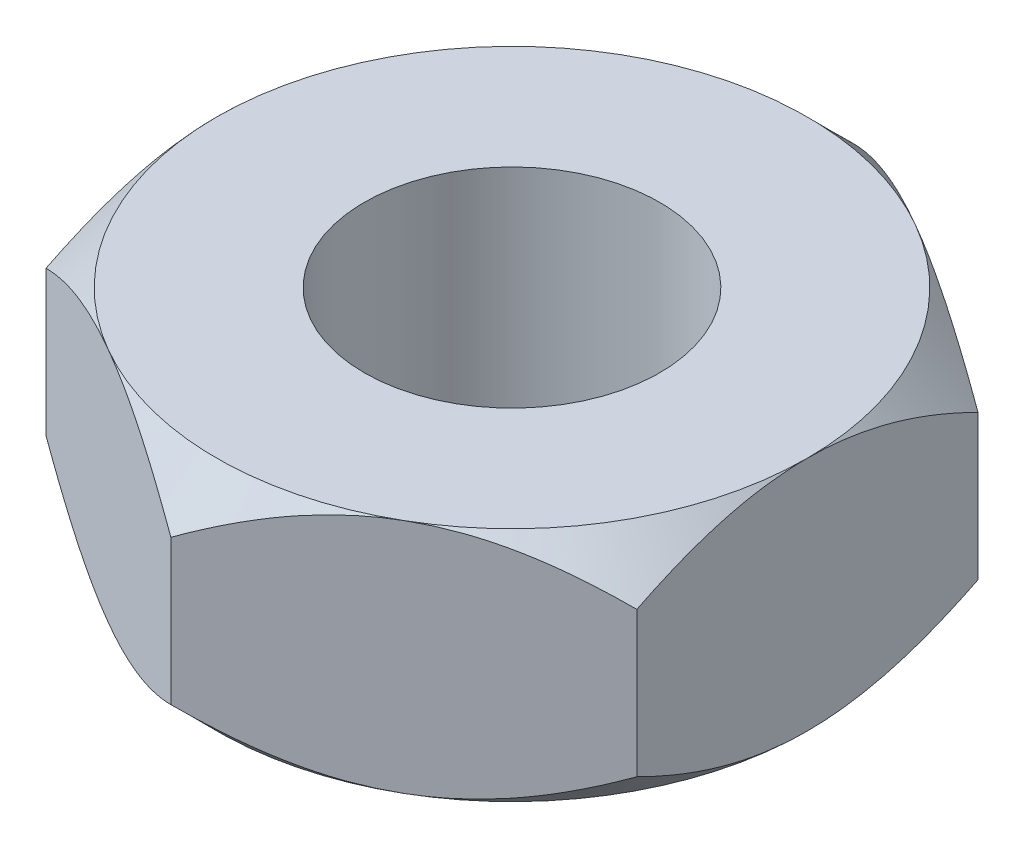
ISO-10303-21;
HEADER;
FILE_DESCRIPTION(('STEP AP214'),'2;1');
FILE_NAME('part.step','',(''),(''),'','','');
FILE_SCHEMA(('AUTOMOTIVE_DESIGN { 1 0 10303 214 1 1 1 1 }'));
ENDSEC;
DATA;
#1=APPLICATION_CONTEXT('core data for automotive mechanical design processes');
#2=APPLICATION_PROTOCOL_DEFINITION('international standard','automotive_design',2000,#1);
#3=PRODUCT_CONTEXT('',#1,'mechanical');
#4=PRODUCT('Part','Part','',(#3));
#5=PRODUCT_RELATED_PRODUCT_CATEGORY('part','',(#4));
#6=PRODUCT_DEFINITION_FORMATION('','',#4);
#7=PRODUCT_DEFINITION_CONTEXT('part definition',#1,'design');
#8=PRODUCT_DEFINITION('design','',#6,#7);
#9=PRODUCT_DEFINITION_SHAPE('','',#8);
#10=(LENGTH_UNIT() NAMED_UNIT(*) SI_UNIT(.MILLI.,.METRE.));
#11=(NAMED_UNIT(*) PLANE_ANGLE_UNIT() SI_UNIT($,.RADIAN.));
#12=(NAMED_UNIT(*) SI_UNIT($,.STERADIAN.) SOLID_ANGLE_UNIT());
#13=UNCERTAINTY_MEASURE_WITH_UNIT(LENGTH_MEASURE(1.E-05),#10,'distance_accuracy_value','');
#14=(GEOMETRIC_REPRESENTATION_CONTEXT(3) GLOBAL_UNCERTAINTY_ASSIGNED_CONTEXT((#13)) GLOBAL_UNIT_ASSIGNED_CONTEXT((#10,
#11,#12)) REPRESENTATION_CONTEXT('',''));
#15=CARTESIAN_POINT('',(0.,0.,0.));
#16=DIRECTION('',(0.,0.,1.));
#17=DIRECTION('',(1.,0.,0.));
#18=AXIS2_PLACEMENT_3D('',#15,#16,#17);
#19=CARTESIAN_POINT('',(1.99999999999999,1.6,-1.15470053837928));
#20=DIRECTION('',(-0.499999999999995,0.,0.866025403784442));
#21=DIRECTION('',(0.866025403784442,0.,0.499999999999995));
#22=AXIS2_PLACEMENT_3D('',#19,#20,#21);
#23=PLANE('',#22);
#24=CARTESIAN_POINT('',(-0.000200000000000004,0.309516555472163,-2.30951654681234));
#25=CARTESIAN_POINT('',(0.0685530340307052,0.269854166984096,-2.26982196410711));
#26=CARTESIAN_POINT('',(0.138455742135511,0.232521059042667,-2.22946361676572));
#27=CARTESIAN_POINT('',(0.280995244550435,0.164164761894649,-2.14716839667631));
#28=CARTESIAN_POINT('',(0.353645597565357,0.133179610495727,-2.10522369580642));
#29=CARTESIAN_POINT('',(0.500141601053969,0.0801012933026502,-2.02064418875707));
#30=CARTESIAN_POINT('',(0.573949935246292,0.057874703935119,-1.97803092714269));
#31=CARTESIAN_POINT('',(0.723191631835261,0.0236298934335896,-1.89186619344274));
#32=CARTESIAN_POINT('',(0.798620433918148,0.0115861059026441,-1.84831735425553));
#33=CARTESIAN_POINT('',(0.928615500671075,0.000719588664081582,-1.77326466747241));
#34=CARTESIAN_POINT('',(0.983013783970105,-0.000889169631519565,-1.74185780396626));
#35=CARTESIAN_POINT('',(1.09172145551969,0.00181995435722156,-1.67909540053413));
#36=CARTESIAN_POINT('',(1.14603080592134,0.00613991451648442,-1.64773988246023));
#37=CARTESIAN_POINT('',(1.25413672758934,0.0204606441684161,-1.58532489948421));
#38=CARTESIAN_POINT('',(1.30793265655479,0.0304677695205167,-1.5542658054147));
#39=CARTESIAN_POINT('',(1.41459426230557,0.0556135070081701,-1.49268469862229));
#40=CARTESIAN_POINT('',(1.46746001007071,0.0707517258007509,-1.46216264491918));
#41=CARTESIAN_POINT('',(1.60287973308984,0.115695580187701,-1.3839780313805));
#42=CARTESIAN_POINT('',(1.68459383484947,0.148889916184325,-1.33680037273299));
#43=CARTESIAN_POINT('',(1.8047470372578,0.204926899929877,-1.26742988897855));
#44=CARTESIAN_POINT('',(1.84434285210917,0.224615779705447,-1.24456923461533));
#45=CARTESIAN_POINT('',(1.92280095888786,0.265788395123377,-1.19927142554654));
#46=CARTESIAN_POINT('',(1.96166368359373,0.287271028409751,-1.17683402097617));
#47=CARTESIAN_POINT('',(2.00019999999999,0.309516555472163,-1.15458506832544));
#48=B_SPLINE_CURVE_WITH_KNOTS('',3,(#24,#25,#26,#27,#28,#29,#30,#31,#32,#33,#34,#35,#36,#37,#38,
#39,#40,#41,#42,#43,#44,#45,#46,#47),.UNSPECIFIED.,.F.,.F.,(4,2,2,2,2,2,2,2,2,2,2,4),(0.,
0.266420613771061,0.534393751523383,0.798110374376907,1.06116288956935,1.24939906803721,
1.43770123566247,1.62621426093931,1.81471283831913,2.11415604834143,2.26347170717788,
2.41269626969768),.UNSPECIFIED.);
#49=CARTESIAN_POINT('',(0.,0.309401076758504,-2.3094010767585));
#50=VERTEX_POINT('',#49);
#51=CARTESIAN_POINT('',(0.99999999999999,0.,-1.73205080756888));
#52=VERTEX_POINT('',#51);
#53=EDGE_CURVE('E52',#50,#52,#48,.T.);
#54=ORIENTED_EDGE('',*,*,#53,.F.);
#55=DIRECTION('',(0.,-1.,0.));
#56=VECTOR('',#55,1.);
#57=CARTESIAN_POINT('',(0.,1.6,-2.3094010767585));
#58=LINE('',#57,#56);
#59=CARTESIAN_POINT('',(0.,1.2905989232415,-2.3094010767585));
#60=VERTEX_POINT('',#59);
#61=EDGE_CURVE('E278',#60,#50,#58,.T.);
#62=ORIENTED_EDGE('',*,*,#61,.F.);
#63=CARTESIAN_POINT('',(2.00019999999999,1.29048344452784,-1.15458506832544));
#64=CARTESIAN_POINT('',(1.93144696596928,1.3301458330159,-1.19427965103067));
#65=CARTESIAN_POINT('',(1.86154425786448,1.36747894095733,-1.23463799837206));
#66=CARTESIAN_POINT('',(1.71900475544955,1.43583523810535,-1.31693321846147));
#67=CARTESIAN_POINT('',(1.64635440243463,1.46682038950427,-1.35887791933136));
#68=CARTESIAN_POINT('',(1.49985839894602,1.51989870669735,-1.44345742638071));
#69=CARTESIAN_POINT('',(1.4260500647537,1.54212529606488,-1.48607068799509));
#70=CARTESIAN_POINT('',(1.27680836816473,1.57637010656641,-1.57223542169504));
#71=CARTESIAN_POINT('',(1.20137956608184,1.58841389409736,-1.61578426088225));
#72=CARTESIAN_POINT('',(1.07138449932891,1.59928041133592,-1.69083694766537));
#73=CARTESIAN_POINT('',(1.01698621602988,1.60088916963152,-1.72224381117152));
#74=CARTESIAN_POINT('',(0.908278544480296,1.59818004564278,-1.78500621460365));
#75=CARTESIAN_POINT('',(0.853969194078651,1.59386008548352,-1.81636173267755));
#76=CARTESIAN_POINT('',(0.745863272410651,1.57953935583158,-1.87877671565357));
#77=CARTESIAN_POINT('',(0.692067343445196,1.56953223047948,-1.90983580972308));
#78=CARTESIAN_POINT('',(0.585405737694414,1.54438649299183,-1.97141691651549));
#79=CARTESIAN_POINT('',(0.532539989929275,1.52924827419925,-2.0019389702186));
#80=CARTESIAN_POINT('',(0.397120266910145,1.4843044198123,-2.08012358375728));
#81=CARTESIAN_POINT('',(0.315406165150513,1.45111008381567,-2.12730124240479));
#82=CARTESIAN_POINT('',(0.195252962742193,1.39507310007012,-2.19667172615923));
#83=CARTESIAN_POINT('',(0.155657147890819,1.37538422029455,-2.21953238052245));
#84=CARTESIAN_POINT('',(0.0771990411121257,1.33421160487662,-2.26483018959124));
#85=CARTESIAN_POINT('',(0.0383363164062586,1.31272897159025,-2.28726759416161));
#86=CARTESIAN_POINT('',(-0.000199999999999872,1.29048344452784,-2.30951654681234));
#87=B_SPLINE_CURVE_WITH_KNOTS('',3,(#63,#64,#65,#66,#67,#68,#69,#70,#71,#72,#73,#74,#75,#76,#77,
#78,#79,#80,#81,#82,#83,#84,#85,#86),.UNSPECIFIED.,.F.,.F.,(4,2,2,2,2,2,2,2,2,2,2,4),(0.,
0.266420613771061,0.534393751523383,0.798110374376907,1.06116288956935,1.24939906803721,
1.43770123566247,1.62621426093931,1.81471283831913,2.11415604834143,2.26347170717788,
2.41269626969768),.UNSPECIFIED.);
#88=CARTESIAN_POINT('',(0.999999999999994,1.6,-1.73205080756889));
#89=VERTEX_POINT('',#88);
#90=EDGE_CURVE('E250',#89,#60,#87,.T.);
#91=ORIENTED_EDGE('',*,*,#90,.F.);
#92=CARTESIAN_POINT('',(1.99999999999999,1.2905989232415,-1.15470053837928));
#93=VERTEX_POINT('',#92);
#94=EDGE_CURVE('E318',#93,#89,#87,.T.);
#95=ORIENTED_EDGE('',*,*,#94,.F.);
#96=DIRECTION('',(0.,-1.,0.));
#97=VECTOR('',#96,1.);
#98=CARTESIAN_POINT('',(1.99999999999999,1.6,-1.15470053837928));
#99=LINE('',#98,#97);
#100=CARTESIAN_POINT('',(1.99999999999999,0.309401076758504,-1.15470053837928));
#101=VERTEX_POINT('',#100);
#102=EDGE_CURVE('E320',#93,#101,#99,.T.);
#103=ORIENTED_EDGE('',*,*,#102,.T.);
#104=EDGE_CURVE('E137',#52,#101,#48,.T.);
#105=ORIENTED_EDGE('',*,*,#104,.F.);
#106=EDGE_LOOP('',(#54,#62,#91,#95,#103,#105));
#107=FACE_BOUND('',#106,.T.);
#108=ADVANCED_FACE('F36',(#107),#23,.F.);
#109=CARTESIAN_POINT('',(0.,1.6,-2.3094010767585));
#110=DIRECTION('',(0.500000000000001,0.,0.866025403784438));
#111=DIRECTION('',(0.866025403784438,0.,-0.500000000000001));
#112=AXIS2_PLACEMENT_3D('',#109,#110,#111);
#113=PLANE('',#112);
#114=CARTESIAN_POINT('',(-2.0002,0.309516555472163,-1.15458506832541));
#115=CARTESIAN_POINT('',(-1.9314469659693,0.269854166984095,-1.19427965103064));
#116=CARTESIAN_POINT('',(-1.86154425786449,0.232521059042665,-1.23463799837204));
#117=CARTESIAN_POINT('',(-1.71900475544957,0.164164761894646,-1.31693321846145));
#118=CARTESIAN_POINT('',(-1.64635440243465,0.133179610495723,-1.35887791933133));
#119=CARTESIAN_POINT('',(-1.49985839894603,0.0801012933026451,-1.44345742638069));
#120=CARTESIAN_POINT('',(-1.42605006475371,0.0578747039351132,-1.48607068799507));
#121=CARTESIAN_POINT('',(-1.27680836816474,0.0236298934335826,-1.57223542169502));
#122=CARTESIAN_POINT('',(-1.20137956608185,0.0115861059026366,-1.61578426088223));
#123=CARTESIAN_POINT('',(-1.07138449932892,0.000719588664073623,-1.69083694766536));
#124=CARTESIAN_POINT('',(-1.01698621602989,-0.000889169631527687,-1.72224381117151));
#125=CARTESIAN_POINT('',(-0.908278544480308,0.00181995435721309,-1.78500621460364));
#126=CARTESIAN_POINT('',(-0.853969194078663,0.00613991451647577,-1.81636173267754));
#127=CARTESIAN_POINT('',(-0.745863272410664,0.0204606441684074,-1.87877671565355));
#128=CARTESIAN_POINT('',(-0.69206734344521,0.0304677695205081,-1.90983580972306));
#129=CARTESIAN_POINT('',(-0.585405737694428,0.0556135070081612,-1.97141691651547));
#130=CARTESIAN_POINT('',(-0.532539989929289,0.0707517258007417,-2.00193897021859));
#131=CARTESIAN_POINT('',(-0.397120266910157,0.115695580187692,-2.08012358375727));
#132=CARTESIAN_POINT('',(-0.315406165150522,0.148889916184318,-2.12730124240478));
#133=CARTESIAN_POINT('',(-0.195252962742198,0.204926899929873,-2.19667172615922));
#134=CARTESIAN_POINT('',(-0.155657147890823,0.224615779705443,-2.21953238052245));
#135=CARTESIAN_POINT('',(-0.0771990411121277,0.265788395123375,-2.26483018959124));
#136=CARTESIAN_POINT('',(-0.0383363164062596,0.28727102840975,-2.28726759416161));
#137=CARTESIAN_POINT('',(0.000200000000000142,0.309516555472163,-2.30951654681234));
#138=B_SPLINE_CURVE_WITH_KNOTS('',3,(#114,#115,#116,#117,#118,#119,#120,#121,#122,#123,#124,
#125,#126,#127,#128,#129,#130,#131,#132,#133,#134,#135,#136,#137),.UNSPECIFIED.,.F.,.F.,(4,2,2,
2,2,2,2,2,2,2,2,4),(0.,0.266420613771064,0.53439375152339,0.798110374376917,1.06116288956937,
1.24939906803722,1.43770123566248,1.62621426093932,1.81471283831914,2.11415604834145,
2.26347170717791,2.41269626969771),.UNSPECIFIED.);
#139=CARTESIAN_POINT('',(-2.,0.309401076758504,-1.15470053837925));
#140=VERTEX_POINT('',#139);
#141=CARTESIAN_POINT('',(-1.,0.,-1.73205080756888));
#142=VERTEX_POINT('',#141);
#143=EDGE_CURVE('E60',#140,#142,#138,.T.);
#144=ORIENTED_EDGE('',*,*,#143,.F.);
#145=DIRECTION('',(0.,-1.,0.));
#146=VECTOR('',#145,1.);
#147=CARTESIAN_POINT('',(-2.,1.6,-1.15470053837925));
#148=LINE('',#147,#146);
#149=CARTESIAN_POINT('',(-2.,1.2905989232415,-1.15470053837925));
#150=VERTEX_POINT('',#149);
#151=EDGE_CURVE('E271',#150,#140,#148,.T.);
#152=ORIENTED_EDGE('',*,*,#151,.F.);
#153=CARTESIAN_POINT('',(0.000200000000000008,1.29048344452784,-2.30951654681234));
#154=CARTESIAN_POINT('',(-0.0685530340307058,1.3301458330159,-2.26982196410711));
#155=CARTESIAN_POINT('',(-0.138455742135512,1.36747894095734,-2.22946361676572));
#156=CARTESIAN_POINT('',(-0.280995244550437,1.43583523810535,-2.1471683966763));
#157=CARTESIAN_POINT('',(-0.353645597565359,1.46682038950428,-2.10522369580642));
#158=CARTESIAN_POINT('',(-0.500141601053973,1.51989870669736,-2.02064418875706));
#159=CARTESIAN_POINT('',(-0.573949935246296,1.54212529606489,-1.97803092714269));
#160=CARTESIAN_POINT('',(-0.723191631835266,1.57637010656642,-1.89186619344273));
#161=CARTESIAN_POINT('',(-0.798620433918154,1.58841389409736,-1.84831735425552));
#162=CARTESIAN_POINT('',(-0.928615500671082,1.59928041133593,-1.7732646674724));
#163=CARTESIAN_POINT('',(-0.983013783970112,1.60088916963153,-1.74185780396625));
#164=CARTESIAN_POINT('',(-1.0917214555197,1.59818004564279,-1.67909540053412));
#165=CARTESIAN_POINT('',(-1.14603080592134,1.59386008548352,-1.64773988246021));
#166=CARTESIAN_POINT('',(-1.25413672758934,1.57953935583159,-1.5853248994842));
#167=CARTESIAN_POINT('',(-1.30793265655479,1.56953223047949,-1.55426580541469));
#168=CARTESIAN_POINT('',(-1.41459426230558,1.54438649299184,-1.49268469862228));
#169=CARTESIAN_POINT('',(-1.46746001007072,1.52924827419926,-1.46216264491916));
#170=CARTESIAN_POINT('',(-1.60287973308985,1.48430441981231,-1.38397803138048));
#171=CARTESIAN_POINT('',(-1.68459383484948,1.45111008381568,-1.33680037273297));
#172=CARTESIAN_POINT('',(-1.80474703725781,1.39507310007013,-1.26742988897853));
#173=CARTESIAN_POINT('',(-1.84434285210918,1.37538422029456,-1.2445692346153));
#174=CARTESIAN_POINT('',(-1.92280095888788,1.33421160487663,-1.19927142554652));
#175=CARTESIAN_POINT('',(-1.96166368359375,1.31272897159025,-1.17683402097614));
#176=CARTESIAN_POINT('',(-2.0002,1.29048344452784,-1.15458506832541));
#177=B_SPLINE_CURVE_WITH_KNOTS('',3,(#153,#154,#155,#156,#157,#158,#159,#160,#161,#162,#163,
#164,#165,#166,#167,#168,#169,#170,#171,#172,#173,#174,#175,#176),.UNSPECIFIED.,.F.,.F.,(4,2,2,
2,2,2,2,2,2,2,2,4),(0.,0.266420613771064,0.534393751523391,0.798110374376917,1.06116288956937,
1.24939906803722,1.43770123566248,1.62621426093932,1.81471283831914,2.11415604834145,
2.26347170717791,2.41269626969771),.UNSPECIFIED.);
#178=CARTESIAN_POINT('',(-1.,1.6,-1.73205080756888));
#179=VERTEX_POINT('',#178);
#180=EDGE_CURVE('E243',#179,#150,#177,.T.);
#181=ORIENTED_EDGE('',*,*,#180,.F.);
#182=EDGE_CURVE('E249',#60,#179,#177,.T.);
#183=ORIENTED_EDGE('',*,*,#182,.F.);
#184=ORIENTED_EDGE('',*,*,#61,.T.);
#185=EDGE_CURVE('E160',#142,#50,#138,.T.);
#186=ORIENTED_EDGE('',*,*,#185,.F.);
#187=EDGE_LOOP('',(#144,#152,#181,#183,#184,#186));
#188=FACE_BOUND('',#187,.T.);
#189=ADVANCED_FACE('F256',(#188),#113,.F.);
#190=CARTESIAN_POINT('',(-2.,1.6,-1.15470053837925));
#191=DIRECTION('',(1.,0.,0.));
#192=DIRECTION('',(0.,0.,-1.));
#193=AXIS2_PLACEMENT_3D('',#190,#191,#192);
#194=PLANE('',#193);
#195=CARTESIAN_POINT('',(-2.00000000000001,1.29019488252983,-2.61254327524453));
#196=CARTESIAN_POINT('',(-2.00000000000001,1.24064534414815,-2.55012778852981));
#197=CARTESIAN_POINT('',(-2.00000000000001,1.19148330047981,-2.48740009058871));
#198=CARTESIAN_POINT('',(-2.00000000000001,1.0941173988925,-2.36118487448526));
#199=CARTESIAN_POINT('',(-2.00000000000001,1.04591374676681,-2.29769719772447));
#200=CARTESIAN_POINT('',(-2.00000000000001,0.950307536984489,-2.16936780427217));
#201=CARTESIAN_POINT('',(-2.00000000000001,0.902913838258009,-2.10451946738864));
#202=CARTESIAN_POINT('',(-2.00000000000001,0.809580787991221,-1.97378837476002));
#203=CARTESIAN_POINT('',(-2.00000000000001,0.763641339653711,-1.90790568830138));
#204=CARTESIAN_POINT('',(-2.00000000000001,0.670147526687691,-1.76987564613341));
#205=CARTESIAN_POINT('',(-2.00000000000001,0.622734688153935,-1.69763195640554));
#206=CARTESIAN_POINT('',(-2.00000000000001,0.530577577337536,-1.55146442665623));
#207=CARTESIAN_POINT('',(-2.00000000000001,0.485832968027409,-1.47754080046576));
#208=CARTESIAN_POINT('',(-2.,0.399917834631021,-1.32791120028739));
#209=CARTESIAN_POINT('',(-2.,0.358737439259264,-1.25221093871324));
#210=CARTESIAN_POINT('',(-2.,0.280881091671754,-1.09854641049698));
#211=CARTESIAN_POINT('',(-2.,0.244202870567784,-1.02058330891973));
#212=CARTESIAN_POINT('',(-2.,0.181029803464532,-0.87223711935323));
#213=CARTESIAN_POINT('',(-2.,0.153832752001086,-0.802156090362227));
#214=CARTESIAN_POINT('',(-2.,0.105040182157819,-0.660033594508962));
#215=CARTESIAN_POINT('',(-2.,0.0834449845291973,-0.587992015650283));
#216=CARTESIAN_POINT('',(-2.,0.0474732392278032,-0.443748253089858));
#217=CARTESIAN_POINT('',(-2.,0.0329510233949112,-0.371583056922965));
#218=CARTESIAN_POINT('',(-2.,0.0114600647392787,-0.226130131551975));
#219=CARTESIAN_POINT('',(-2.,0.00448913863026258,-0.152842733025714));
#220=CARTESIAN_POINT('',(-2.,-0.00116339348483317,-0.0103634777354571));
#221=CARTESIAN_POINT('',(-2.,-0.000318383061124951,0.0588095691835743));
#222=CARTESIAN_POINT('',(-2.,0.00847068441443788,0.196699474123196));
#223=CARTESIAN_POINT('',(-2.,0.0164152870195975,0.265416296677364));
#224=CARTESIAN_POINT('',(-2.,0.0390597197043327,0.403074136856636));
#225=CARTESIAN_POINT('',(-2.,0.0538872817581779,0.471993766190368));
#226=CARTESIAN_POINT('',(-2.,0.0894169378625835,0.608270025322452));
#227=CARTESIAN_POINT('',(-2.,0.110119020964438,0.675626658033603));
#228=CARTESIAN_POINT('',(-2.,0.17976569086058,0.875863394424112));
#229=CARTESIAN_POINT('',(-2.,0.236106709815166,1.00615820059957));
#230=CARTESIAN_POINT('',(-2.,0.361570324526107,1.26069744733846));
#231=CARTESIAN_POINT('',(-2.,0.430736681980139,1.38491927485267));
#232=CARTESIAN_POINT('',(-1.99999999999999,0.538807465716636,1.56449502677459));
#233=CARTESIAN_POINT('',(-1.99999999999999,0.574551900249282,1.62178989348194));
#234=CARTESIAN_POINT('',(-1.99999999999999,0.647583221318526,1.73539571794536));
#235=CARTESIAN_POINT('',(-1.99999999999999,0.684870221444954,1.79170660280819));
#236=CARTESIAN_POINT('',(-1.99999999999999,0.760406855331997,1.9030251252792));
#237=CARTESIAN_POINT('',(-1.99999999999999,0.798646539051194,1.95803954900724));
#238=CARTESIAN_POINT('',(-1.99999999999999,0.87616202513888,2.06731164689541));
#239=CARTESIAN_POINT('',(-1.99999999999999,0.915437539395688,2.12156952519856));
#240=CARTESIAN_POINT('',(-1.99999999999999,0.955138269586996,2.17550963968852));
#241=B_SPLINE_CURVE_WITH_KNOTS('',3,(#195,#196,#197,#198,#199,#200,#201,#202,#203,#204,#205,
#206,#207,#208,#209,#210,#211,#212,#213,#214,#215,#216,#217,#218,#219,#220,#221,#222,#223,#224,
#225,#226,#227,#228,#229,#230,#231,#232,#233,#234,#235,#236,#237,#238,#239,#240),.UNSPECIFIED.,
.F.,.F.,(4,2,2,2,2,2,2,2,2,2,2,2,2,2,2,2,2,2,2,2,2,2,4),(0.,0.239080449310993,0.478211693165812,
0.719158208726349,0.960088652639677,1.21928095842057,1.47844045563563,1.73685755422555,
1.9951438831296,2.22047513680923,2.44581928966948,2.66630243337519,2.88672181228999,
3.09388290836222,3.30105992466437,3.51224559004557,3.72343086182966,4.14807332597343,
4.57419231623005,4.77676462727743,4.97935188177691,5.18033632757739,5.38126544805775),.UNSPECIFIED.);
#242=CARTESIAN_POINT('',(-2.,0.309401076758504,1.15470053837926));
#243=VERTEX_POINT('',#242);
#244=CARTESIAN_POINT('',(-2.,0.,0.));
#245=VERTEX_POINT('',#244);
#246=EDGE_CURVE('E347',#243,#245,#241,.F.);
#247=ORIENTED_EDGE('',*,*,#246,.F.);
#248=DIRECTION('',(0.,-1.,0.));
#249=VECTOR('',#248,1.);
#250=CARTESIAN_POINT('',(-2.,1.6,1.15470053837926));
#251=LINE('',#250,#249);
#252=CARTESIAN_POINT('',(-2.,1.2905989232415,1.15470053837926));
#253=VERTEX_POINT('',#252);
#254=EDGE_CURVE('E279',#253,#243,#251,.T.);
#255=ORIENTED_EDGE('',*,*,#254,.F.);
#256=CARTESIAN_POINT('',(-2.00000000000001,0.309805117470175,-2.61254327524453));
#257=CARTESIAN_POINT('',(-2.00000000000001,0.359354655851849,-2.55012778852981));
#258=CARTESIAN_POINT('',(-2.00000000000001,0.40851669952019,-2.48740009058871));
#259=CARTESIAN_POINT('',(-2.00000000000001,0.5058826011075,-2.36118487448526));
#260=CARTESIAN_POINT('',(-2.00000000000001,0.554086253233187,-2.29769719772447));
#261=CARTESIAN_POINT('',(-2.00000000000001,0.649692463015511,-2.16936780427217));
#262=CARTESIAN_POINT('',(-2.00000000000001,0.697086161741992,-2.10451946738864));
#263=CARTESIAN_POINT('',(-2.00000000000001,0.79041921200878,-1.97378837476002));
#264=CARTESIAN_POINT('',(-2.00000000000001,0.836358660346289,-1.90790568830138));
#265=CARTESIAN_POINT('',(-2.00000000000001,0.929852473312309,-1.76987564613341));
#266=CARTESIAN_POINT('',(-2.00000000000001,0.977265311846065,-1.69763195640554));
#267=CARTESIAN_POINT('',(-2.00000000000001,1.06942242266246,-1.55146442665623));
#268=CARTESIAN_POINT('',(-2.00000000000001,1.11416703197259,-1.47754080046576));
#269=CARTESIAN_POINT('',(-2.,1.20008216536898,-1.32791120028739));
#270=CARTESIAN_POINT('',(-2.,1.24126256074074,-1.25221093871324));
#271=CARTESIAN_POINT('',(-2.,1.31911890832825,-1.09854641049698));
#272=CARTESIAN_POINT('',(-2.,1.35579712943222,-1.02058330891973));
#273=CARTESIAN_POINT('',(-2.,1.41897019653547,-0.87223711935323));
#274=CARTESIAN_POINT('',(-2.,1.44616724799891,-0.802156090362227));
#275=CARTESIAN_POINT('',(-2.,1.49495981784218,-0.660033594508963));
#276=CARTESIAN_POINT('',(-2.,1.5165550154708,-0.587992015650283));
#277=CARTESIAN_POINT('',(-2.,1.5525267607722,-0.443748253089858));
#278=CARTESIAN_POINT('',(-2.,1.56704897660509,-0.371583056922966));
#279=CARTESIAN_POINT('',(-2.,1.58853993526072,-0.226130131551975));
#280=CARTESIAN_POINT('',(-2.,1.59551086136974,-0.152842733025714));
#281=CARTESIAN_POINT('',(-2.,1.60116339348483,-0.0103634777354565));
#282=CARTESIAN_POINT('',(-2.,1.60031838306112,0.0588095691835751));
#283=CARTESIAN_POINT('',(-2.,1.59152931558556,0.196699474123197));
#284=CARTESIAN_POINT('',(-2.,1.5835847129804,0.265416296677365));
#285=CARTESIAN_POINT('',(-2.,1.56094028029567,0.403074136856637));
#286=CARTESIAN_POINT('',(-2.,1.54611271824182,0.471993766190368));
#287=CARTESIAN_POINT('',(-2.,1.51058306213742,0.608270025322452));
#288=CARTESIAN_POINT('',(-2.,1.48988097903556,0.675626658033603));
#289=CARTESIAN_POINT('',(-2.,1.42023430913942,0.875863394424112));
#290=CARTESIAN_POINT('',(-2.,1.36389329018483,1.00615820059957));
#291=CARTESIAN_POINT('',(-2.,1.23842967547389,1.26069744733846));
#292=CARTESIAN_POINT('',(-2.,1.16926331801986,1.38491927485267));
#293=CARTESIAN_POINT('',(-1.99999999999999,1.06119253428336,1.56449502677459));
#294=CARTESIAN_POINT('',(-1.99999999999999,1.02544809975072,1.62178989348194));
#295=CARTESIAN_POINT('',(-1.99999999999999,0.952416778681474,1.73539571794536));
#296=CARTESIAN_POINT('',(-1.99999999999999,0.915129778555046,1.79170660280819));
#297=CARTESIAN_POINT('',(-1.99999999999999,0.839593144668003,1.9030251252792));
#298=CARTESIAN_POINT('',(-1.99999999999999,0.801353460948806,1.95803954900724));
#299=CARTESIAN_POINT('',(-1.99999999999999,0.72383797486112,2.06731164689541));
#300=CARTESIAN_POINT('',(-1.99999999999999,0.684562460604312,2.12156952519857));
#301=CARTESIAN_POINT('',(-1.99999999999999,0.644861730413004,2.17550963968852));
#302=B_SPLINE_CURVE_WITH_KNOTS('',3,(#256,#257,#258,#259,#260,#261,#262,#263,#264,#265,#266,
#267,#268,#269,#270,#271,#272,#273,#274,#275,#276,#277,#278,#279,#280,#281,#282,#283,#284,#285,
#286,#287,#288,#289,#290,#291,#292,#293,#294,#295,#296,#297,#298,#299,#300,#301),.UNSPECIFIED.,
.F.,.F.,(4,2,2,2,2,2,2,2,2,2,2,2,2,2,2,2,2,2,2,2,2,2,4),(0.,0.239080449310993,0.478211693165812,
0.71915820872635,0.960088652639677,1.21928095842057,1.47844045563563,1.73685755422555,
1.9951438831296,2.22047513680923,2.44581928966948,2.66630243337518,2.88672181228999,
3.09388290836222,3.30105992466437,3.51224559004557,3.72343086182966,4.14807332597343,
4.57419231623005,4.77676462727743,4.97935188177691,5.18033632757739,5.38126544805775),.UNSPECIFIED.);
#303=CARTESIAN_POINT('',(-2.,1.6,0.));
#304=VERTEX_POINT('',#303);
#305=EDGE_CURVE('E236',#304,#253,#302,.T.);
#306=ORIENTED_EDGE('',*,*,#305,.F.);
#307=EDGE_CURVE('E242',#150,#304,#302,.T.);
#308=ORIENTED_EDGE('',*,*,#307,.F.);
#309=ORIENTED_EDGE('',*,*,#151,.T.);
#310=EDGE_CURVE('E195',#245,#140,#241,.F.);
#311=ORIENTED_EDGE('',*,*,#310,.F.);
#312=EDGE_LOOP('',(#247,#255,#306,#308,#309,#311));
#313=FACE_BOUND('',#312,.T.);
#314=ADVANCED_FACE('F217',(#313),#194,.F.);
#315=CARTESIAN_POINT('',(-2.,1.6,1.15470053837926));
#316=DIRECTION('',(0.499999999999995,0.,-0.866025403784442));
#317=DIRECTION('',(-0.866025403784442,0.,-0.499999999999995));
#318=AXIS2_PLACEMENT_3D('',#315,#316,#317);
#319=PLANE('',#318);
#320=CARTESIAN_POINT('',(0.000200000000016131,0.309516555472163,2.30951654681234));
#321=CARTESIAN_POINT('',(-0.0685530340306898,0.269854166984095,2.26982196410711));
#322=CARTESIAN_POINT('',(-0.138455742135496,0.232521059042665,2.22946361676572));
#323=CARTESIAN_POINT('',(-0.280995244550422,0.164164761894646,2.14716839667631));
#324=CARTESIAN_POINT('',(-0.353645597565344,0.133179610495723,2.10522369580642));
#325=CARTESIAN_POINT('',(-0.500141601053958,0.0801012933026448,2.02064418875707));
#326=CARTESIAN_POINT('',(-0.573949935246282,0.0578747039351128,1.97803092714269));
#327=CARTESIAN_POINT('',(-0.723191631835253,0.0236298934335822,1.89186619344273));
#328=CARTESIAN_POINT('',(-0.798620433918141,0.0115861059026363,1.84831735425553));
#329=CARTESIAN_POINT('',(-0.928615500671069,0.00071958866407349,1.7732646674724));
#330=CARTESIAN_POINT('',(-0.983013783970099,-0.000889169631527772,1.74185780396625));
#331=CARTESIAN_POINT('',(-1.09172145551968,0.00181995435721307,1.67909540053412));
#332=CARTESIAN_POINT('',(-1.14603080592133,0.00613991451647579,1.64773988246022));
#333=CARTESIAN_POINT('',(-1.25413672758933,0.0204606441684073,1.58532489948421));
#334=CARTESIAN_POINT('',(-1.30793265655478,0.030467769520508,1.5542658054147));
#335=CARTESIAN_POINT('',(-1.41459426230556,0.0556135070081611,1.49268469862229));
#336=CARTESIAN_POINT('',(-1.4674600100707,0.0707517258007416,1.46216264491917));
#337=CARTESIAN_POINT('',(-1.60287973308984,0.115695580187693,1.3839780313805));
#338=CARTESIAN_POINT('',(-1.68459383484947,0.148889916184318,1.33680037273298));
#339=CARTESIAN_POINT('',(-1.8047470372578,0.204926899929872,1.26742988897854));
#340=CARTESIAN_POINT('',(-1.84434285210917,0.224615779705442,1.24456923461532));
#341=CARTESIAN_POINT('',(-1.92280095888787,0.265788395123374,1.19927142554653));
#342=CARTESIAN_POINT('',(-1.96166368359374,0.28727102840975,1.17683402097615));
#343=CARTESIAN_POINT('',(-2.0002,0.309516555472163,1.15458506832542));
#344=B_SPLINE_CURVE_WITH_KNOTS('',3,(#320,#321,#322,#323,#324,#325,#326,#327,#328,#329,#330,
#331,#332,#333,#334,#335,#336,#337,#338,#339,#340,#341,#342,#343),.UNSPECIFIED.,.F.,.F.,(4,2,2,
2,2,2,2,2,2,2,2,4),(0.,0.266420613771064,0.53439375152339,0.798110374376917,1.06116288956937,
1.24939906803722,1.43770123566248,1.62621426093932,1.81471283831914,2.11415604834145,
2.26347170717791,2.41269626969771),.UNSPECIFIED.);
#345=CARTESIAN_POINT('',(0.,0.309401076758504,2.3094010767585));
#346=VERTEX_POINT('',#345);
#347=CARTESIAN_POINT('',(-0.99999999999999,0.,1.73205080756888));
#348=VERTEX_POINT('',#347);
#349=EDGE_CURVE('E146',#346,#348,#344,.T.);
#350=ORIENTED_EDGE('',*,*,#349,.F.);
#351=DIRECTION('',(0.,-1.,0.));
#352=VECTOR('',#351,1.);
#353=CARTESIAN_POINT('',(0.,1.6,2.3094010767585));
#354=LINE('',#353,#352);
#355=CARTESIAN_POINT('',(0.,1.2905989232415,2.3094010767585));
#356=VERTEX_POINT('',#355);
#357=EDGE_CURVE('E159',#356,#346,#354,.T.);
#358=ORIENTED_EDGE('',*,*,#357,.F.);
#359=CARTESIAN_POINT('',(-2.0002,1.29048344452784,1.15458506832542));
#360=CARTESIAN_POINT('',(-1.93144696596929,1.33014583301591,1.19427965103065));
#361=CARTESIAN_POINT('',(-1.86154425786448,1.36747894095734,1.23463799837205));
#362=CARTESIAN_POINT('',(-1.71900475544956,1.43583523810535,1.31693321846146));
#363=CARTESIAN_POINT('',(-1.64635440243464,1.46682038950428,1.35887791933135));
#364=CARTESIAN_POINT('',(-1.49985839894602,1.51989870669736,1.4434574263807));
#365=CARTESIAN_POINT('',(-1.4260500647537,1.54212529606489,1.48607068799508));
#366=CARTESIAN_POINT('',(-1.27680836816473,1.57637010656642,1.57223542169503));
#367=CARTESIAN_POINT('',(-1.20137956608184,1.58841389409736,1.61578426088224));
#368=CARTESIAN_POINT('',(-1.07138449932891,1.59928041133593,1.69083694766536));
#369=CARTESIAN_POINT('',(-1.01698621602988,1.60088916963153,1.72224381117151));
#370=CARTESIAN_POINT('',(-0.908278544480297,1.59818004564279,1.78500621460364));
#371=CARTESIAN_POINT('',(-0.853969194078652,1.59386008548352,1.81636173267754));
#372=CARTESIAN_POINT('',(-0.745863272410653,1.57953935583159,1.87877671565356));
#373=CARTESIAN_POINT('',(-0.692067343445198,1.56953223047949,1.90983580972307));
#374=CARTESIAN_POINT('',(-0.585405737694417,1.54438649299184,1.97141691651548));
#375=CARTESIAN_POINT('',(-0.532539989929277,1.52924827419926,2.00193897021859));
#376=CARTESIAN_POINT('',(-0.397120266910144,1.48430441981231,2.08012358375727));
#377=CARTESIAN_POINT('',(-0.315406165150509,1.45111008381568,2.12730124240478));
#378=CARTESIAN_POINT('',(-0.195252962742184,1.39507310007013,2.19667172615923));
#379=CARTESIAN_POINT('',(-0.155657147890808,1.37538422029456,2.21953238052245));
#380=CARTESIAN_POINT('',(-0.0771990411121122,1.33421160487663,2.26483018959124));
#381=CARTESIAN_POINT('',(-0.0383363164062437,1.31272897159025,2.28726759416161));
#382=CARTESIAN_POINT('',(0.000200000000016104,1.29048344452784,2.30951654681234));
#383=B_SPLINE_CURVE_WITH_KNOTS('',3,(#359,#360,#361,#362,#363,#364,#365,#366,#367,#368,#369,
#370,#371,#372,#373,#374,#375,#376,#377,#378,#379,#380,#381,#382),.UNSPECIFIED.,.F.,.F.,(4,2,2,
2,2,2,2,2,2,2,2,4),(0.,0.266420613771064,0.53439375152339,0.798110374376916,1.06116288956937,
1.24939906803722,1.43770123566248,1.62621426093932,1.81471283831913,2.11415604834145,
2.26347170717791,2.41269626969771),.UNSPECIFIED.);
#384=CARTESIAN_POINT('',(-0.99999999999999,1.6,1.73205080756888));
#385=VERTEX_POINT('',#384);
#386=EDGE_CURVE('E222',#385,#356,#383,.T.);
#387=ORIENTED_EDGE('',*,*,#386,.F.);
#388=EDGE_CURVE('E229',#253,#385,#383,.T.);
#389=ORIENTED_EDGE('',*,*,#388,.F.);
#390=ORIENTED_EDGE('',*,*,#254,.T.);
#391=EDGE_CURVE('E162',#348,#243,#344,.T.);
#392=ORIENTED_EDGE('',*,*,#391,.F.);
#393=EDGE_LOOP('',(#350,#358,#387,#389,#390,#392));
#394=FACE_BOUND('',#393,.T.);
#395=ADVANCED_FACE('F214',(#394),#319,.F.);
#396=CARTESIAN_POINT('',(0.,1.6,2.3094010767585));
#397=DIRECTION('',(-0.500000000000007,0.,-0.866025403784435));
#398=DIRECTION('',(-0.866025403784435,0.,0.500000000000007));
#399=AXIS2_PLACEMENT_3D('',#396,#397,#398);
#400=PLANE('',#399);
#401=CARTESIAN_POINT('',(2.00020000000001,0.309516555472163,1.1545850683254));
#402=CARTESIAN_POINT('',(1.93144696596931,0.269854166984095,1.19427965103063));
#403=CARTESIAN_POINT('',(1.8615442578645,0.232521059042665,1.23463799837202));
#404=CARTESIAN_POINT('',(1.71900475544958,0.164164761894645,1.31693321846144));
#405=CARTESIAN_POINT('',(1.64635440243465,0.133179610495723,1.35887791933132));
#406=CARTESIAN_POINT('',(1.49985839894604,0.0801012933026446,1.44345742638068));
#407=CARTESIAN_POINT('',(1.42605006475372,0.0578747039351128,1.48607068799506));
#408=CARTESIAN_POINT('',(1.27680836816475,0.0236298934335822,1.57223542169502));
#409=CARTESIAN_POINT('',(1.20137956608186,0.0115861059026362,1.61578426088222));
#410=CARTESIAN_POINT('',(1.07138449932893,0.000719588664073491,1.69083694766535));
#411=CARTESIAN_POINT('',(1.0169862160299,-0.000889169631527705,1.7222438111715));
#412=CARTESIAN_POINT('',(0.90827854448032,0.00181995435721332,1.78500621460363));
#413=CARTESIAN_POINT('',(0.853969194078675,0.00613991451647613,1.81636173267753));
#414=CARTESIAN_POINT('',(0.745863272410677,0.0204606441684078,1.87877671565355));
#415=CARTESIAN_POINT('',(0.692067343445223,0.0304677695205085,1.90983580972306));
#416=CARTESIAN_POINT('',(0.585405737694442,0.0556135070081616,1.97141691651547));
#417=CARTESIAN_POINT('',(0.532539989929303,0.0707517258007421,2.00193897021858));
#418=CARTESIAN_POINT('',(0.397120266910171,0.115695580187693,2.08012358375727));
#419=CARTESIAN_POINT('',(0.315406165150537,0.148889916184319,2.12730124240478));
#420=CARTESIAN_POINT('',(0.195252962742213,0.204926899929873,2.19667172615922));
#421=CARTESIAN_POINT('',(0.155657147890839,0.224615779705443,2.21953238052245));
#422=CARTESIAN_POINT('',(0.0771990411121436,0.265788395123375,2.26483018959124));
#423=CARTESIAN_POINT('',(0.0383363164062756,0.28727102840975,2.28726759416161));
#424=CARTESIAN_POINT('',(-0.000199999999983961,0.309516555472163,2.30951654681234));
#425=B_SPLINE_CURVE_WITH_KNOTS('',3,(#401,#402,#403,#404,#405,#406,#407,#408,#409,#410,#411,
#412,#413,#414,#415,#416,#417,#418,#419,#420,#421,#422,#423,#424),.UNSPECIFIED.,.F.,.F.,(4,2,2,
2,2,2,2,2,2,2,2,4),(0.,0.266420613771065,0.534393751523391,0.798110374376918,1.06116288956937,
1.24939906803722,1.43770123566248,1.62621426093932,1.81471283831914,2.11415604834145,
2.26347170717791,2.41269626969771),.UNSPECIFIED.);
#426=CARTESIAN_POINT('',(2.00000000000001,0.309401076758504,1.15470053837923));
#427=VERTEX_POINT('',#426);
#428=CARTESIAN_POINT('',(1.00000000000001,0.,1.73205080756887));
#429=VERTEX_POINT('',#428);
#430=EDGE_CURVE('E126',#427,#429,#425,.T.);
#431=ORIENTED_EDGE('',*,*,#430,.F.);
#432=DIRECTION('',(0.,-1.,0.));
#433=VECTOR('',#432,1.);
#434=CARTESIAN_POINT('',(2.00000000000001,1.6,1.15470053837923));
#435=LINE('',#434,#433);
#436=CARTESIAN_POINT('',(2.00000000000001,1.2905989232415,1.15470053837923));
#437=VERTEX_POINT('',#436);
#438=EDGE_CURVE('E325',#437,#427,#435,.T.);
#439=ORIENTED_EDGE('',*,*,#438,.F.);
#440=CARTESIAN_POINT('',(-0.00019999999998388,1.29048344452784,2.30951654681234));
#441=CARTESIAN_POINT('',(0.0685530340307216,1.3301458330159,2.26982196410711));
#442=CARTESIAN_POINT('',(0.138455742135528,1.36747894095734,2.22946361676572));
#443=CARTESIAN_POINT('',(0.280995244550452,1.43583523810535,2.1471683966763));
#444=CARTESIAN_POINT('',(0.353645597565374,1.46682038950428,2.10522369580642));
#445=CARTESIAN_POINT('',(0.500141601053987,1.51989870669736,2.02064418875706));
#446=CARTESIAN_POINT('',(0.57394993524631,1.54212529606489,1.97803092714268));
#447=CARTESIAN_POINT('',(0.723191631835279,1.57637010656642,1.89186619344272));
#448=CARTESIAN_POINT('',(0.798620433918167,1.58841389409736,1.84831735425552));
#449=CARTESIAN_POINT('',(0.928615500671094,1.59928041133593,1.77326466747239));
#450=CARTESIAN_POINT('',(0.983013783970123,1.60088916963153,1.74185780396624));
#451=CARTESIAN_POINT('',(1.09172145551971,1.59818004564279,1.67909540053411));
#452=CARTESIAN_POINT('',(1.14603080592135,1.59386008548352,1.6477398824602));
#453=CARTESIAN_POINT('',(1.25413672758935,1.57953935583159,1.58532489948419));
#454=CARTESIAN_POINT('',(1.30793265655481,1.56953223047949,1.55426580541468));
#455=CARTESIAN_POINT('',(1.41459426230559,1.54438649299184,1.49268469862227));
#456=CARTESIAN_POINT('',(1.46746001007073,1.52924827419926,1.46216264491915));
#457=CARTESIAN_POINT('',(1.60287973308986,1.48430441981231,1.38397803138047));
#458=CARTESIAN_POINT('',(1.68459383484949,1.45111008381568,1.33680037273296));
#459=CARTESIAN_POINT('',(1.80474703725781,1.39507310007013,1.26742988897852));
#460=CARTESIAN_POINT('',(1.84434285210919,1.37538422029456,1.24456923461529));
#461=CARTESIAN_POINT('',(1.92280095888788,1.33421160487663,1.1992714255465));
#462=CARTESIAN_POINT('',(1.96166368359375,1.31272897159025,1.17683402097613));
#463=CARTESIAN_POINT('',(2.00020000000001,1.29048344452784,1.1545850683254));
#464=B_SPLINE_CURVE_WITH_KNOTS('',3,(#440,#441,#442,#443,#444,#445,#446,#447,#448,#449,#450,
#451,#452,#453,#454,#455,#456,#457,#458,#459,#460,#461,#462,#463),.UNSPECIFIED.,.F.,.F.,(4,2,2,
2,2,2,2,2,2,2,2,4),(0.,0.266420613771065,0.534393751523391,0.798110374376917,1.06116288956937,
1.24939906803722,1.43770123566248,1.62621426093932,1.81471283831914,2.11415604834145,
2.26347170717791,2.41269626969771),.UNSPECIFIED.);
#465=CARTESIAN_POINT('',(1.00000000000001,1.6,1.73205080756887));
#466=VERTEX_POINT('',#465);
#467=EDGE_CURVE('E231',#466,#437,#464,.T.);
#468=ORIENTED_EDGE('',*,*,#467,.F.);
#469=EDGE_CURVE('E230',#356,#466,#464,.T.);
#470=ORIENTED_EDGE('',*,*,#469,.F.);
#471=ORIENTED_EDGE('',*,*,#357,.T.);
#472=EDGE_CURVE('E140',#429,#346,#425,.T.);
#473=ORIENTED_EDGE('',*,*,#472,.F.);
#474=EDGE_LOOP('',(#431,#439,#468,#470,#471,#473));
#475=FACE_BOUND('',#474,.T.);
#476=ADVANCED_FACE('F156',(#475),#400,.F.);
#477=CARTESIAN_POINT('',(2.00000000000001,1.6,1.15470053837923));
#478=DIRECTION('',(-1.,0.,0.));
#479=DIRECTION('',(0.,0.,1.));
#480=AXIS2_PLACEMENT_3D('',#477,#478,#479);
#481=PLANE('',#480);
#482=CARTESIAN_POINT('',(1.99999999999997,1.29019488252983,-2.61254327524456));
#483=CARTESIAN_POINT('',(1.99999999999997,1.24064534414815,-2.55012778852984));
#484=CARTESIAN_POINT('',(1.99999999999997,1.19148330047981,-2.48740009058874));
#485=CARTESIAN_POINT('',(1.99999999999998,1.0941173988925,-2.36118487448529));
#486=CARTESIAN_POINT('',(1.99999999999998,1.04591374676681,-2.2976971977245));
#487=CARTESIAN_POINT('',(1.99999999999998,0.95030753698449,-2.1693678042722));
#488=CARTESIAN_POINT('',(1.99999999999998,0.902913838258009,-2.10451946738867));
#489=CARTESIAN_POINT('',(1.99999999999998,0.80958078799122,-1.97378837476004));
#490=CARTESIAN_POINT('',(1.99999999999998,0.763641339653711,-1.90790568830141));
#491=CARTESIAN_POINT('',(1.99999999999998,0.670147526687691,-1.76987564613344));
#492=CARTESIAN_POINT('',(1.99999999999998,0.622734688153935,-1.69763195640557));
#493=CARTESIAN_POINT('',(1.99999999999998,0.530577577337536,-1.55146442665626));
#494=CARTESIAN_POINT('',(1.99999999999998,0.48583296802741,-1.47754080046579));
#495=CARTESIAN_POINT('',(1.99999999999999,0.399917834631021,-1.32791120028741));
#496=CARTESIAN_POINT('',(1.99999999999999,0.358737439259264,-1.25221093871327));
#497=CARTESIAN_POINT('',(1.99999999999999,0.280881091671754,-1.09854641049701));
#498=CARTESIAN_POINT('',(1.99999999999999,0.244202870567784,-1.02058330891976));
#499=CARTESIAN_POINT('',(1.99999999999999,0.181029803464532,-0.872237119353258));
#500=CARTESIAN_POINT('',(1.99999999999999,0.153832752001086,-0.802156090362255));
#501=CARTESIAN_POINT('',(1.99999999999999,0.105040182157819,-0.660033594508991));
#502=CARTESIAN_POINT('',(1.99999999999999,0.0834449845291972,-0.587992015650311));
#503=CARTESIAN_POINT('',(2.,0.0474732392278029,-0.443748253089886));
#504=CARTESIAN_POINT('',(2.,0.0329510233949108,-0.371583056922994));
#505=CARTESIAN_POINT('',(2.,0.0114600647392786,-0.226130131552003));
#506=CARTESIAN_POINT('',(2.,0.00448913863026275,-0.152842733025742));
#507=CARTESIAN_POINT('',(2.,-0.00116339348483295,-0.0103634777354849));
#508=CARTESIAN_POINT('',(2.,-0.00031838306112494,0.0588095691835465));
#509=CARTESIAN_POINT('',(2.,0.00847068441443795,0.196699474123168));
#510=CARTESIAN_POINT('',(2.,0.0164152870195978,0.265416296677336));
#511=CARTESIAN_POINT('',(2.,0.039059719704333,0.403074136856608));
#512=CARTESIAN_POINT('',(2.,0.0538872817581778,0.47199376619034));
#513=CARTESIAN_POINT('',(2.00000000000001,0.0894169378625831,0.608270025322423));
#514=CARTESIAN_POINT('',(2.00000000000001,0.110119020964438,0.675626658033574));
#515=CARTESIAN_POINT('',(2.00000000000001,0.17976569086058,0.875863394424083));
#516=CARTESIAN_POINT('',(2.00000000000001,0.236106709815165,1.00615820059954));
#517=CARTESIAN_POINT('',(2.00000000000001,0.361570324526106,1.26069744733843));
#518=CARTESIAN_POINT('',(2.00000000000001,0.430736681980138,1.38491927485264));
#519=CARTESIAN_POINT('',(2.00000000000002,0.538807465716635,1.56449502677456));
#520=CARTESIAN_POINT('',(2.00000000000002,0.574551900249281,1.62178989348191));
#521=CARTESIAN_POINT('',(2.00000000000002,0.647583221318525,1.73539571794533));
#522=CARTESIAN_POINT('',(2.00000000000002,0.684870221444953,1.79170660280816));
#523=CARTESIAN_POINT('',(2.00000000000002,0.760406855331996,1.90302512527917));
#524=CARTESIAN_POINT('',(2.00000000000002,0.798646539051193,1.95803954900721));
#525=CARTESIAN_POINT('',(2.00000000000002,0.876162025138879,2.06731164689538));
#526=CARTESIAN_POINT('',(2.00000000000002,0.915437539395686,2.12156952519854));
#527=CARTESIAN_POINT('',(2.00000000000002,0.955138269586995,2.17550963968849));
#528=B_SPLINE_CURVE_WITH_KNOTS('',3,(#482,#483,#484,#485,#486,#487,#488,#489,#490,#491,#492,
#493,#494,#495,#496,#497,#498,#499,#500,#501,#502,#503,#504,#505,#506,#507,#508,#509,#510,#511,
#512,#513,#514,#515,#516,#517,#518,#519,#520,#521,#522,#523,#524,#525,#526,#527),.UNSPECIFIED.,
.F.,.F.,(4,2,2,2,2,2,2,2,2,2,2,2,2,2,2,2,2,2,2,2,2,2,4),(0.,0.239080449310993,0.478211693165813,
0.71915820872635,0.960088652639678,1.21928095842057,1.47844045563563,1.73685755422555,
1.9951438831296,2.22047513680923,2.44581928966948,2.66630243337519,2.88672181228999,
3.09388290836222,3.30105992466437,3.51224559004557,3.72343086182966,4.14807332597343,
4.57419231623005,4.77676462727743,4.97935188177691,5.18033632757739,5.38126544805775),.UNSPECIFIED.);
#529=CARTESIAN_POINT('',(2.,0.,0.));
#530=VERTEX_POINT('',#529);
#531=EDGE_CURVE('E138',#101,#530,#528,.T.);
#532=ORIENTED_EDGE('',*,*,#531,.F.);
#533=ORIENTED_EDGE('',*,*,#102,.F.);
#534=CARTESIAN_POINT('',(1.99999999999997,0.309805117470175,-2.61254327524456));
#535=CARTESIAN_POINT('',(1.99999999999997,0.359354655851849,-2.55012778852984));
#536=CARTESIAN_POINT('',(1.99999999999997,0.40851669952019,-2.48740009058874));
#537=CARTESIAN_POINT('',(1.99999999999998,0.5058826011075,-2.36118487448528));
#538=CARTESIAN_POINT('',(1.99999999999998,0.554086253233187,-2.2976971977245));
#539=CARTESIAN_POINT('',(1.99999999999998,0.649692463015511,-2.1693678042722));
#540=CARTESIAN_POINT('',(1.99999999999998,0.697086161741991,-2.10451946738867));
#541=CARTESIAN_POINT('',(1.99999999999998,0.79041921200878,-1.97378837476004));
#542=CARTESIAN_POINT('',(1.99999999999998,0.83635866034629,-1.90790568830141));
#543=CARTESIAN_POINT('',(1.99999999999998,0.92985247331231,-1.76987564613344));
#544=CARTESIAN_POINT('',(1.99999999999998,0.977265311846066,-1.69763195640557));
#545=CARTESIAN_POINT('',(1.99999999999998,1.06942242266246,-1.55146442665626));
#546=CARTESIAN_POINT('',(1.99999999999998,1.11416703197259,-1.47754080046579));
#547=CARTESIAN_POINT('',(1.99999999999999,1.20008216536898,-1.32791120028741));
#548=CARTESIAN_POINT('',(1.99999999999999,1.24126256074074,-1.25221093871327));
#549=CARTESIAN_POINT('',(1.99999999999999,1.31911890832825,-1.09854641049701));
#550=CARTESIAN_POINT('',(1.99999999999999,1.35579712943222,-1.02058330891976));
#551=CARTESIAN_POINT('',(1.99999999999999,1.41897019653547,-0.872237119353257));
#552=CARTESIAN_POINT('',(1.99999999999999,1.44616724799891,-0.802156090362255));
#553=CARTESIAN_POINT('',(1.99999999999999,1.49495981784218,-0.66003359450899));
#554=CARTESIAN_POINT('',(1.99999999999999,1.5165550154708,-0.587992015650311));
#555=CARTESIAN_POINT('',(2.,1.5525267607722,-0.443748253089886));
#556=CARTESIAN_POINT('',(2.,1.56704897660509,-0.371583056922993));
#557=CARTESIAN_POINT('',(2.,1.58853993526072,-0.226130131552003));
#558=CARTESIAN_POINT('',(2.,1.59551086136974,-0.152842733025742));
#559=CARTESIAN_POINT('',(2.,1.60116339348483,-0.0103634777354849));
#560=CARTESIAN_POINT('',(2.,1.60031838306112,0.0588095691835465));
#561=CARTESIAN_POINT('',(2.,1.59152931558556,0.196699474123168));
#562=CARTESIAN_POINT('',(2.,1.5835847129804,0.265416296677336));
#563=CARTESIAN_POINT('',(2.,1.56094028029567,0.403074136856608));
#564=CARTESIAN_POINT('',(2.,1.54611271824182,0.47199376619034));
#565=CARTESIAN_POINT('',(2.00000000000001,1.51058306213742,0.608270025322423));
#566=CARTESIAN_POINT('',(2.00000000000001,1.48988097903556,0.675626658033574));
#567=CARTESIAN_POINT('',(2.00000000000001,1.42023430913942,0.875863394424083));
#568=CARTESIAN_POINT('',(2.00000000000001,1.36389329018483,1.00615820059954));
#569=CARTESIAN_POINT('',(2.00000000000001,1.23842967547389,1.26069744733843));
#570=CARTESIAN_POINT('',(2.00000000000001,1.16926331801986,1.38491927485264));
#571=CARTESIAN_POINT('',(2.00000000000002,1.06119253428337,1.56449502677456));
#572=CARTESIAN_POINT('',(2.00000000000002,1.02544809975072,1.62178989348191));
#573=CARTESIAN_POINT('',(2.00000000000002,0.952416778681475,1.73539571794533));
#574=CARTESIAN_POINT('',(2.00000000000002,0.915129778555047,1.79170660280816));
#575=CARTESIAN_POINT('',(2.00000000000002,0.839593144668004,1.90302512527917));
#576=CARTESIAN_POINT('',(2.00000000000002,0.801353460948807,1.95803954900721));
#577=CARTESIAN_POINT('',(2.00000000000002,0.723837974861121,2.06731164689538));
#578=CARTESIAN_POINT('',(2.00000000000002,0.684562460604314,2.12156952519854));
#579=CARTESIAN_POINT('',(2.00000000000002,0.644861730413005,2.17550963968849));
#580=B_SPLINE_CURVE_WITH_KNOTS('',3,(#534,#535,#536,#537,#538,#539,#540,#541,#542,#543,#544,
#545,#546,#547,#548,#549,#550,#551,#552,#553,#554,#555,#556,#557,#558,#559,#560,#561,#562,#563,
#564,#565,#566,#567,#568,#569,#570,#571,#572,#573,#574,#575,#576,#577,#578,#579),.UNSPECIFIED.,
.F.,.F.,(4,2,2,2,2,2,2,2,2,2,2,2,2,2,2,2,2,2,2,2,2,2,4),(0.,0.239080449310993,0.478211693165813,
0.719158208726351,0.960088652639679,1.21928095842057,1.47844045563563,1.73685755422555,
1.9951438831296,2.22047513680923,2.44581928966948,2.66630243337519,2.88672181228999,
3.09388290836222,3.30105992466437,3.51224559004557,3.72343086182966,4.14807332597343,
4.57419231623005,4.77676462727743,4.97935188177691,5.18033632757739,5.38126544805775),.UNSPECIFIED.);
#581=CARTESIAN_POINT('',(2.,1.6,0.));
#582=VERTEX_POINT('',#581);
#583=EDGE_CURVE('E281',#582,#93,#580,.F.);
#584=ORIENTED_EDGE('',*,*,#583,.F.);
#585=EDGE_CURVE('E151',#437,#582,#580,.F.);
#586=ORIENTED_EDGE('',*,*,#585,.F.);
#587=ORIENTED_EDGE('',*,*,#438,.T.);
#588=EDGE_CURVE('E132',#530,#427,#528,.T.);
#589=ORIENTED_EDGE('',*,*,#588,.F.);
#590=EDGE_LOOP('',(#532,#533,#584,#586,#587,#589));
#591=FACE_BOUND('',#590,.T.);
#592=ADVANCED_FACE('F290',(#591),#481,.F.);
#593=CARTESIAN_POINT('',(0.,0.,0.));
#594=DIRECTION('',(0.,1.,0.));
#595=DIRECTION('',(0.,0.,1.));
#596=AXIS2_PLACEMENT_3D('',#593,#594,#595);
#597=PLANE('',#596);
#598=CARTESIAN_POINT('',(0.,0.,0.));
#599=DIRECTION('',(0.,1.,0.));
#600=DIRECTION('',(0.,0.,1.));
#601=AXIS2_PLACEMENT_3D('',#598,#599,#600);
#602=CIRCLE('',#601,1.);
#603=CARTESIAN_POINT('',(0.,0.,1.));
#604=VERTEX_POINT('',#603);
#605=EDGE_CURVE('E317',#604,#604,#602,.T.);
#606=ORIENTED_EDGE('',*,*,#605,.T.);
#607=EDGE_LOOP('',(#606));
#608=FACE_BOUND('',#607,.T.);
#609=CARTESIAN_POINT('',(0.,0.,0.));
#610=DIRECTION('',(0.,1.,0.));
#611=DIRECTION('',(0.,0.,1.));
#612=AXIS2_PLACEMENT_3D('',#609,#610,#611);
#613=CIRCLE('',#612,2.);
#614=EDGE_CURVE('E12',#429,#530,#613,.T.);
#615=ORIENTED_EDGE('',*,*,#614,.F.);
#616=EDGE_CURVE('E40',#348,#429,#613,.T.);
#617=ORIENTED_EDGE('',*,*,#616,.F.);
#618=EDGE_CURVE('E150',#245,#348,#613,.T.);
#619=ORIENTED_EDGE('',*,*,#618,.F.);
#620=EDGE_CURVE('E494',#142,#245,#613,.T.);
#621=ORIENTED_EDGE('',*,*,#620,.F.);
#622=EDGE_CURVE('E45',#52,#142,#613,.T.);
#623=ORIENTED_EDGE('',*,*,#622,.F.);
#624=CARTESIAN_POINT('',(0.,0.,0.));
#625=DIRECTION('',(0.,-1.,0.));
#626=DIRECTION('',(0.,0.,-1.));
#627=AXIS2_PLACEMENT_3D('',#624,#625,#626);
#628=CIRCLE('',#627,2.);
#629=EDGE_CURVE('E154',#52,#530,#628,.T.);
#630=ORIENTED_EDGE('',*,*,#629,.T.);
#631=EDGE_LOOP('',(#615,#617,#619,#621,#623,#630));
#632=FACE_BOUND('',#631,.T.);
#633=ADVANCED_FACE('F152',(#608,#632),#597,.F.);
#634=CARTESIAN_POINT('',(0.,1.6,0.));
#635=DIRECTION('',(0.,1.,0.));
#636=DIRECTION('',(0.,0.,1.));
#637=AXIS2_PLACEMENT_3D('',#634,#635,#636);
#638=PLANE('',#637);
#639=CARTESIAN_POINT('',(0.,1.6,0.));
#640=DIRECTION('',(0.,1.,0.));
#641=DIRECTION('',(0.,0.,1.));
#642=AXIS2_PLACEMENT_3D('',#639,#640,#641);
#643=CIRCLE('',#642,1.);
#644=CARTESIAN_POINT('',(0.,1.6,1.));
#645=VERTEX_POINT('',#644);
#646=EDGE_CURVE('E314',#645,#645,#643,.T.);
#647=ORIENTED_EDGE('',*,*,#646,.F.);
#648=EDGE_LOOP('',(#647));
#649=FACE_BOUND('',#648,.T.);
#650=CARTESIAN_POINT('',(0.,1.6,0.));
#651=DIRECTION('',(0.,1.,0.));
#652=DIRECTION('',(0.,0.,1.));
#653=AXIS2_PLACEMENT_3D('',#650,#651,#652);
#654=CIRCLE('',#653,2.);
#655=EDGE_CURVE('E336',#385,#466,#654,.T.);
#656=ORIENTED_EDGE('',*,*,#655,.T.);
#657=EDGE_CURVE('E332',#466,#582,#654,.T.);
#658=ORIENTED_EDGE('',*,*,#657,.T.);
#659=EDGE_CURVE('E343',#582,#89,#654,.T.);
#660=ORIENTED_EDGE('',*,*,#659,.T.);
#661=EDGE_CURVE('E354',#89,#179,#654,.T.);
#662=ORIENTED_EDGE('',*,*,#661,.T.);
#663=EDGE_CURVE('E348',#179,#304,#654,.T.);
#664=ORIENTED_EDGE('',*,*,#663,.T.);
#665=EDGE_CURVE('E346',#304,#385,#654,.T.);
#666=ORIENTED_EDGE('',*,*,#665,.T.);
#667=EDGE_LOOP('',(#656,#658,#660,#662,#664,#666));
#668=FACE_BOUND('',#667,.T.);
#669=ADVANCED_FACE('F298',(#649,#668),#638,.T.);
#670=CARTESIAN_POINT('',(0.,1.6,0.));
#671=DIRECTION('',(0.,-1.,0.));
#672=DIRECTION('',(0.,0.,-1.));
#673=AXIS2_PLACEMENT_3D('',#670,#671,#672);
#674=CYLINDRICAL_SURFACE('',#673,1.);
#675=ORIENTED_EDGE('',*,*,#646,.T.);
#676=EDGE_LOOP('',(#675));
#677=FACE_BOUND('',#676,.T.);
#678=ORIENTED_EDGE('',*,*,#605,.F.);
#679=EDGE_LOOP('',(#678));
#680=FACE_BOUND('',#679,.T.);
#681=ADVANCED_FACE('F301',(#677,#680),#674,.F.);
#682=CARTESIAN_POINT('',(0.,1.6,0.));
#683=DIRECTION('',(0.,-1.,0.));
#684=DIRECTION('',(0.,0.,1.));
#685=AXIS2_PLACEMENT_3D('',#682,#683,#684);
#686=CONICAL_SURFACE('',#685,2.,0.78539816339745);
#687=ORIENTED_EDGE('',*,*,#94,.T.);
#688=ORIENTED_EDGE('',*,*,#659,.F.);
#689=ORIENTED_EDGE('',*,*,#583,.T.);
#690=EDGE_LOOP('',(#687,#688,#689));
#691=FACE_BOUND('',#690,.T.);
#692=ADVANCED_FACE('F189',(#691),#686,.T.);
#693=ORIENTED_EDGE('',*,*,#467,.T.);
#694=ORIENTED_EDGE('',*,*,#585,.T.);
#695=ORIENTED_EDGE('',*,*,#657,.F.);
#696=EDGE_LOOP('',(#693,#694,#695));
#697=FACE_BOUND('',#696,.T.);
#698=ADVANCED_FACE('F308',(#697),#686,.T.);
#699=ORIENTED_EDGE('',*,*,#386,.T.);
#700=ORIENTED_EDGE('',*,*,#469,.T.);
#701=ORIENTED_EDGE('',*,*,#655,.F.);
#702=EDGE_LOOP('',(#699,#700,#701));
#703=FACE_BOUND('',#702,.T.);
#704=ADVANCED_FACE('F334',(#703),#686,.T.);
#705=ORIENTED_EDGE('',*,*,#305,.T.);
#706=ORIENTED_EDGE('',*,*,#388,.T.);
#707=ORIENTED_EDGE('',*,*,#665,.F.);
#708=EDGE_LOOP('',(#705,#706,#707));
#709=FACE_BOUND('',#708,.T.);
#710=ADVANCED_FACE('F352',(#709),#686,.T.);
#711=ORIENTED_EDGE('',*,*,#180,.T.);
#712=ORIENTED_EDGE('',*,*,#307,.T.);
#713=ORIENTED_EDGE('',*,*,#663,.F.);
#714=EDGE_LOOP('',(#711,#712,#713));
#715=FACE_BOUND('',#714,.T.);
#716=ADVANCED_FACE('F364',(#715),#686,.T.);
#717=ORIENTED_EDGE('',*,*,#90,.T.);
#718=ORIENTED_EDGE('',*,*,#182,.T.);
#719=ORIENTED_EDGE('',*,*,#661,.F.);
#720=EDGE_LOOP('',(#717,#718,#719));
#721=FACE_BOUND('',#720,.T.);
#722=ADVANCED_FACE('F310',(#721),#686,.T.);
#723=CARTESIAN_POINT('',(0.,0.,0.));
#724=DIRECTION('',(0.,1.,0.));
#725=DIRECTION('',(0.,0.,-1.));
#726=AXIS2_PLACEMENT_3D('',#723,#724,#725);
#727=CONICAL_SURFACE('',#726,2.,0.78539816339745);
#728=ORIENTED_EDGE('',*,*,#349,.T.);
#729=ORIENTED_EDGE('',*,*,#616,.T.);
#730=ORIENTED_EDGE('',*,*,#472,.T.);
#731=EDGE_LOOP('',(#728,#729,#730));
#732=FACE_BOUND('',#731,.T.);
#733=ADVANCED_FACE('F144',(#732),#727,.T.);
#734=ORIENTED_EDGE('',*,*,#246,.T.);
#735=ORIENTED_EDGE('',*,*,#618,.T.);
#736=ORIENTED_EDGE('',*,*,#391,.T.);
#737=EDGE_LOOP('',(#734,#735,#736));
#738=FACE_BOUND('',#737,.T.);
#739=ADVANCED_FACE('F183',(#738),#727,.T.);
#740=ORIENTED_EDGE('',*,*,#310,.T.);
#741=ORIENTED_EDGE('',*,*,#143,.T.);
#742=ORIENTED_EDGE('',*,*,#620,.T.);
#743=EDGE_LOOP('',(#740,#741,#742));
#744=FACE_BOUND('',#743,.T.);
#745=ADVANCED_FACE('F187',(#744),#727,.T.);
#746=ORIENTED_EDGE('',*,*,#185,.T.);
#747=ORIENTED_EDGE('',*,*,#53,.T.);
#748=ORIENTED_EDGE('',*,*,#622,.T.);
#749=EDGE_LOOP('',(#746,#747,#748));
#750=FACE_BOUND('',#749,.T.);
#751=ADVANCED_FACE('F454',(#750),#727,.T.);
#752=ORIENTED_EDGE('',*,*,#104,.T.);
#753=ORIENTED_EDGE('',*,*,#531,.T.);
#754=ORIENTED_EDGE('',*,*,#629,.F.);
#755=EDGE_LOOP('',(#752,#753,#754));
#756=FACE_BOUND('',#755,.T.);
#757=ADVANCED_FACE('F453',(#756),#727,.T.);
#758=ORIENTED_EDGE('',*,*,#430,.T.);
#759=ORIENTED_EDGE('',*,*,#614,.T.);
#760=ORIENTED_EDGE('',*,*,#588,.T.);
#761=EDGE_LOOP('',(#758,#759,#760));
#762=FACE_BOUND('',#761,.T.);
#763=ADVANCED_FACE('F128',(#762),#727,.T.);
#764=CLOSED_SHELL('',(#108,#189,#314,#395,#476,#592,#633,#669,#681,#692,#698,#704,#710,#716,
#722,#733,#739,#745,#751,#757,#763));
#765=MANIFOLD_SOLID_BREP('B2',#764);
#766=ADVANCED_BREP_SHAPE_REPRESENTATION('',(#18,#765),#14);
#767=SHAPE_DEFINITION_REPRESENTATION(#9,#766);
ENDSEC;
END-ISO-10303-21;
